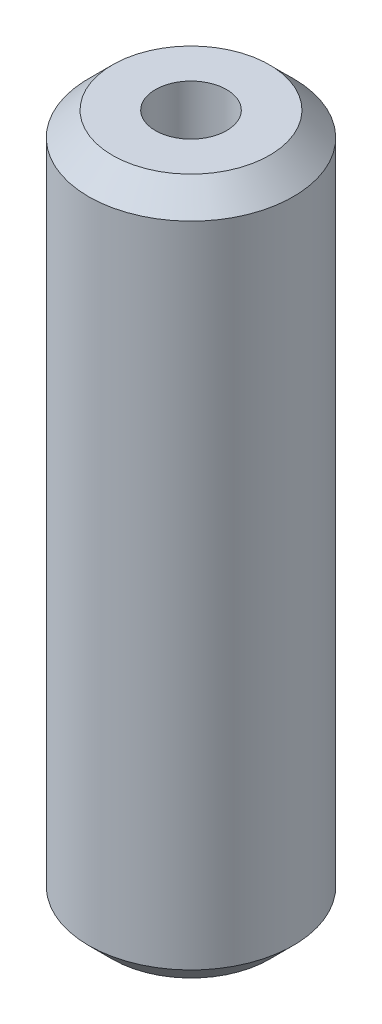
ISO-10303-21;
HEADER;
FILE_DESCRIPTION(('STEP AP214'),'2;1');
FILE_NAME('part.step','',(''),(''),'','','');
FILE_SCHEMA(('AUTOMOTIVE_DESIGN { 1 0 10303 214 1 1 1 1 }'));
ENDSEC;
DATA;
#1=APPLICATION_CONTEXT('core data for automotive mechanical design processes');
#2=APPLICATION_PROTOCOL_DEFINITION('international standard','automotive_design',2000,#1);
#3=PRODUCT_CONTEXT('',#1,'mechanical');
#4=PRODUCT('Part','Part','',(#3));
#5=PRODUCT_RELATED_PRODUCT_CATEGORY('part','',(#4));
#6=PRODUCT_DEFINITION_FORMATION('','',#4);
#7=PRODUCT_DEFINITION_CONTEXT('part definition',#1,'design');
#8=PRODUCT_DEFINITION('design','',#6,#7);
#9=PRODUCT_DEFINITION_SHAPE('','',#8);
#10=(LENGTH_UNIT() NAMED_UNIT(*) SI_UNIT(.MILLI.,.METRE.));
#11=(NAMED_UNIT(*) PLANE_ANGLE_UNIT() SI_UNIT($,.RADIAN.));
#12=(NAMED_UNIT(*) SI_UNIT($,.STERADIAN.) SOLID_ANGLE_UNIT());
#13=UNCERTAINTY_MEASURE_WITH_UNIT(LENGTH_MEASURE(1.E-05),#10,'distance_accuracy_value','');
#14=(GEOMETRIC_REPRESENTATION_CONTEXT(3) GLOBAL_UNCERTAINTY_ASSIGNED_CONTEXT((#13)) GLOBAL_UNIT_ASSIGNED_CONTEXT((#10,
#11,#12)) REPRESENTATION_CONTEXT('',''));
#15=CARTESIAN_POINT('',(0.,0.,0.));
#16=DIRECTION('',(0.,0.,1.));
#17=DIRECTION('',(1.,0.,0.));
#18=AXIS2_PLACEMENT_3D('',#15,#16,#17);
#19=CARTESIAN_POINT('',(0.,136.049361739418,0.));
#20=DIRECTION('',(0.,-1.,0.));
#21=DIRECTION('',(0.,0.,-1.));
#22=AXIS2_PLACEMENT_3D('',#19,#20,#21);
#23=CYLINDRICAL_SURFACE('',#22,20.);
#24=CARTESIAN_POINT('',(0.,131.387713750093,0.));
#25=DIRECTION('',(0.,1.,0.));
#26=DIRECTION('',(0.,0.,1.));
#27=AXIS2_PLACEMENT_3D('',#24,#25,#26);
#28=CIRCLE('',#27,20.);
#29=CARTESIAN_POINT('',(0.,131.387713750093,20.));
#30=VERTEX_POINT('',#29);
#31=EDGE_CURVE('E50',#30,#30,#28,.F.);
#32=ORIENTED_EDGE('',*,*,#31,.T.);
#33=EDGE_LOOP('',(#32));
#34=FACE_BOUND('',#33,.T.);
#35=CARTESIAN_POINT('',(0.,4.66164798932459,0.));
#36=DIRECTION('',(0.,1.,0.));
#37=DIRECTION('',(0.,0.,1.));
#38=AXIS2_PLACEMENT_3D('',#35,#36,#37);
#39=CIRCLE('',#38,20.);
#40=CARTESIAN_POINT('',(0.,4.66164798932459,20.));
#41=VERTEX_POINT('',#40);
#42=EDGE_CURVE('E51',#41,#41,#39,.T.);
#43=ORIENTED_EDGE('',*,*,#42,.T.);
#44=EDGE_LOOP('',(#43));
#45=FACE_BOUND('',#44,.T.);
#46=ADVANCED_FACE('F39',(#34,#45),#23,.T.);
#47=CARTESIAN_POINT('',(0.,136.049361739418,0.));
#48=DIRECTION('',(0.,1.,0.));
#49=DIRECTION('',(0.,0.,1.));
#50=AXIS2_PLACEMENT_3D('',#47,#48,#49);
#51=PLANE('',#50);
#52=CARTESIAN_POINT('',(0.,136.049361739418,0.));
#53=DIRECTION('',(0.,1.,0.));
#54=DIRECTION('',(0.,0.,1.));
#55=AXIS2_PLACEMENT_3D('',#52,#53,#54);
#56=CIRCLE('',#55,15.3383520106754);
#57=CARTESIAN_POINT('',(0.,136.049361739418,15.3383520106754));
#58=VERTEX_POINT('',#57);
#59=EDGE_CURVE('E54',#58,#58,#56,.T.);
#60=ORIENTED_EDGE('',*,*,#59,.T.);
#61=EDGE_LOOP('',(#60));
#62=FACE_BOUND('',#61,.T.);
#63=CARTESIAN_POINT('',(0.,136.049361739418,0.));
#64=DIRECTION('',(0.,1.,0.));
#65=DIRECTION('',(0.,0.,1.));
#66=AXIS2_PLACEMENT_3D('',#63,#64,#65);
#67=CIRCLE('',#66,6.95820141400092);
#68=CARTESIAN_POINT('',(0.,136.049361739418,6.95820141400092));
#69=VERTEX_POINT('',#68);
#70=EDGE_CURVE('E58',#69,#69,#67,.T.);
#71=ORIENTED_EDGE('',*,*,#70,.F.);
#72=EDGE_LOOP('',(#71));
#73=FACE_BOUND('',#72,.T.);
#74=ADVANCED_FACE('F69',(#62,#73),#51,.T.);
#75=CARTESIAN_POINT('',(0.,0.,0.));
#76=DIRECTION('',(0.,1.,0.));
#77=DIRECTION('',(0.,0.,1.));
#78=AXIS2_PLACEMENT_3D('',#75,#76,#77);
#79=PLANE('',#78);
#80=CARTESIAN_POINT('',(0.,0.,0.));
#81=DIRECTION('',(0.,1.,0.));
#82=DIRECTION('',(0.,0.,1.));
#83=AXIS2_PLACEMENT_3D('',#80,#81,#82);
#84=CIRCLE('',#83,15.3383520106754);
#85=CARTESIAN_POINT('',(0.,0.,15.3383520106754));
#86=VERTEX_POINT('',#85);
#87=EDGE_CURVE('E10',#86,#86,#84,.F.);
#88=ORIENTED_EDGE('',*,*,#87,.T.);
#89=EDGE_LOOP('',(#88));
#90=FACE_BOUND('',#89,.T.);
#91=CARTESIAN_POINT('',(0.,0.,0.));
#92=DIRECTION('',(0.,1.,0.));
#93=DIRECTION('',(0.,0.,1.));
#94=AXIS2_PLACEMENT_3D('',#91,#92,#93);
#95=CIRCLE('',#94,6.95820141400092);
#96=CARTESIAN_POINT('',(0.,0.,6.95820141400092));
#97=VERTEX_POINT('',#96);
#98=EDGE_CURVE('E63',#97,#97,#95,.T.);
#99=ORIENTED_EDGE('',*,*,#98,.T.);
#100=EDGE_LOOP('',(#99));
#101=FACE_BOUND('',#100,.T.);
#102=ADVANCED_FACE('F75',(#90,#101),#79,.F.);
#103=CARTESIAN_POINT('',(0.,136.049361739418,0.));
#104=DIRECTION('',(0.,-1.,0.));
#105=DIRECTION('',(0.,0.,-1.));
#106=AXIS2_PLACEMENT_3D('',#103,#104,#105);
#107=CYLINDRICAL_SURFACE('',#106,6.95820141400092);
#108=ORIENTED_EDGE('',*,*,#70,.T.);
#109=EDGE_LOOP('',(#108));
#110=FACE_BOUND('',#109,.T.);
#111=ORIENTED_EDGE('',*,*,#98,.F.);
#112=EDGE_LOOP('',(#111));
#113=FACE_BOUND('',#112,.T.);
#114=ADVANCED_FACE('F70',(#110,#113),#107,.F.);
#115=CARTESIAN_POINT('',(0.,136.049361739418,0.));
#116=DIRECTION('',(0.,-1.,0.));
#117=DIRECTION('',(0.,0.,-1.));
#118=AXIS2_PLACEMENT_3D('',#115,#116,#117);
#119=CONICAL_SURFACE('',#118,15.3383520106754,0.785398163397445);
#120=ORIENTED_EDGE('',*,*,#31,.F.);
#121=EDGE_LOOP('',(#120));
#122=FACE_BOUND('',#121,.T.);
#123=ORIENTED_EDGE('',*,*,#59,.F.);
#124=EDGE_LOOP('',(#123));
#125=FACE_BOUND('',#124,.T.);
#126=ADVANCED_FACE('F81',(#122,#125),#119,.T.);
#127=CARTESIAN_POINT('',(0.,4.66164798932459,0.));
#128=DIRECTION('',(0.,1.,0.));
#129=DIRECTION('',(0.,0.,1.));
#130=AXIS2_PLACEMENT_3D('',#127,#128,#129);
#131=CONICAL_SURFACE('',#130,20.,0.785398163397451);
#132=ORIENTED_EDGE('',*,*,#87,.F.);
#133=EDGE_LOOP('',(#132));
#134=FACE_BOUND('',#133,.T.);
#135=ORIENTED_EDGE('',*,*,#42,.F.);
#136=EDGE_LOOP('',(#135));
#137=FACE_BOUND('',#136,.T.);
#138=ADVANCED_FACE('F45',(#134,#137),#131,.T.);
#139=CLOSED_SHELL('',(#46,#74,#102,#114,#126,#138));
#140=MANIFOLD_SOLID_BREP('B2',#139);
#141=ADVANCED_BREP_SHAPE_REPRESENTATION('',(#18,#140),#14);
#142=SHAPE_DEFINITION_REPRESENTATION(#9,#141);
ENDSEC;
END-ISO-10303-21;
